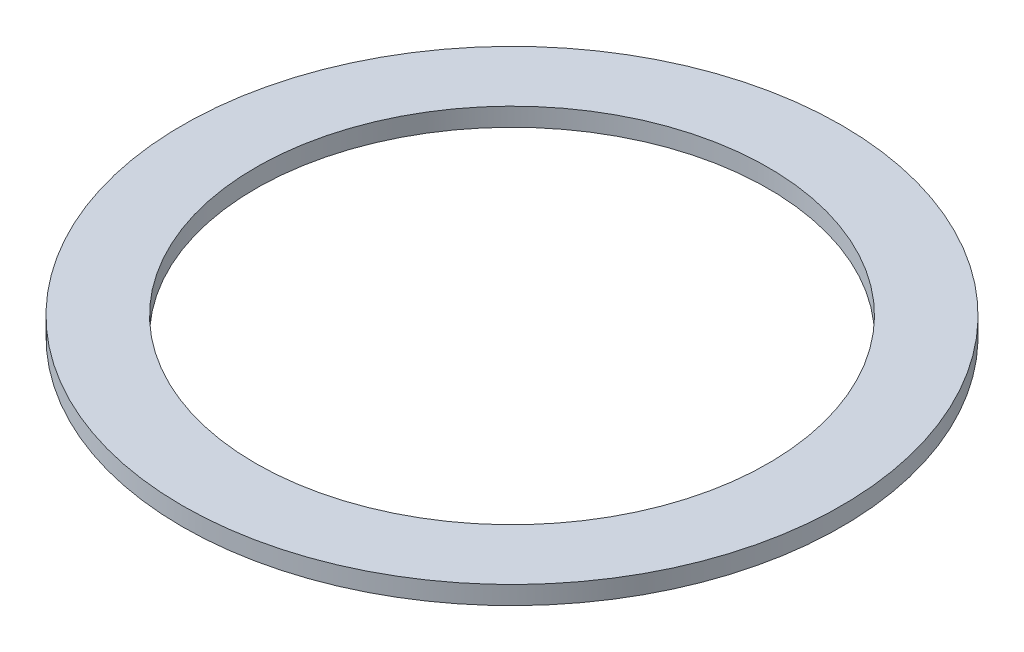
ISO-10303-21;
HEADER;
FILE_DESCRIPTION(('STEP AP214'),'2;1');
FILE_NAME('part.step','',(''),(''),'','','');
FILE_SCHEMA(('AUTOMOTIVE_DESIGN { 1 0 10303 214 1 1 1 1 }'));
ENDSEC;
DATA;
#1=APPLICATION_CONTEXT('core data for automotive mechanical design processes');
#2=APPLICATION_PROTOCOL_DEFINITION('international standard','automotive_design',2000,#1);
#3=PRODUCT_CONTEXT('',#1,'mechanical');
#4=PRODUCT('Part','Part','',(#3));
#5=PRODUCT_RELATED_PRODUCT_CATEGORY('part','',(#4));
#6=PRODUCT_DEFINITION_FORMATION('','',#4);
#7=PRODUCT_DEFINITION_CONTEXT('part definition',#1,'design');
#8=PRODUCT_DEFINITION('design','',#6,#7);
#9=PRODUCT_DEFINITION_SHAPE('','',#8);
#10=(LENGTH_UNIT() NAMED_UNIT(*) SI_UNIT(.MILLI.,.METRE.));
#11=(NAMED_UNIT(*) PLANE_ANGLE_UNIT() SI_UNIT($,.RADIAN.));
#12=(NAMED_UNIT(*) SI_UNIT($,.STERADIAN.) SOLID_ANGLE_UNIT());
#13=UNCERTAINTY_MEASURE_WITH_UNIT(LENGTH_MEASURE(1.E-05),#10,'distance_accuracy_value','');
#14=(GEOMETRIC_REPRESENTATION_CONTEXT(3) GLOBAL_UNCERTAINTY_ASSIGNED_CONTEXT((#13)) GLOBAL_UNIT_ASSIGNED_CONTEXT((#10,
#11,#12)) REPRESENTATION_CONTEXT('',''));
#15=CARTESIAN_POINT('',(0.,0.,0.));
#16=DIRECTION('',(0.,0.,1.));
#17=DIRECTION('',(1.,0.,0.));
#18=AXIS2_PLACEMENT_3D('',#15,#16,#17);
#19=CARTESIAN_POINT('',(0.,5.,0.));
#20=DIRECTION('',(0.,1.,0.));
#21=DIRECTION('',(0.,0.,1.));
#22=AXIS2_PLACEMENT_3D('',#19,#20,#21);
#23=PLANE('',#22);
#24=CARTESIAN_POINT('',(0.,5.,0.));
#25=DIRECTION('',(0.,1.,0.));
#26=DIRECTION('',(0.,0.,1.));
#27=AXIS2_PLACEMENT_3D('',#24,#25,#26);
#28=CIRCLE('',#27,90.);
#29=CARTESIAN_POINT('',(0.,5.,90.));
#30=VERTEX_POINT('',#29);
#31=EDGE_CURVE('E10',#30,#30,#28,.T.);
#32=ORIENTED_EDGE('',*,*,#31,.T.);
#33=EDGE_LOOP('',(#32));
#34=FACE_BOUND('',#33,.T.);
#35=CARTESIAN_POINT('',(0.,5.,0.));
#36=DIRECTION('',(0.,1.,0.));
#37=DIRECTION('',(0.,0.,1.));
#38=AXIS2_PLACEMENT_3D('',#35,#36,#37);
#39=CIRCLE('',#38,70.);
#40=CARTESIAN_POINT('',(0.,5.,70.));
#41=VERTEX_POINT('',#40);
#42=EDGE_CURVE('E47',#41,#41,#39,.T.);
#43=ORIENTED_EDGE('',*,*,#42,.F.);
#44=EDGE_LOOP('',(#43));
#45=FACE_BOUND('',#44,.T.);
#46=ADVANCED_FACE('F36',(#34,#45),#23,.T.);
#47=CARTESIAN_POINT('',(0.,0.,0.));
#48=DIRECTION('',(0.,1.,0.));
#49=DIRECTION('',(0.,0.,1.));
#50=AXIS2_PLACEMENT_3D('',#47,#48,#49);
#51=PLANE('',#50);
#52=CARTESIAN_POINT('',(0.,0.,0.));
#53=DIRECTION('',(0.,1.,0.));
#54=DIRECTION('',(0.,0.,1.));
#55=AXIS2_PLACEMENT_3D('',#52,#53,#54);
#56=CIRCLE('',#55,90.);
#57=CARTESIAN_POINT('',(0.,0.,90.));
#58=VERTEX_POINT('',#57);
#59=EDGE_CURVE('E40',#58,#58,#56,.T.);
#60=ORIENTED_EDGE('',*,*,#59,.F.);
#61=EDGE_LOOP('',(#60));
#62=FACE_BOUND('',#61,.T.);
#63=CARTESIAN_POINT('',(0.,0.,0.));
#64=DIRECTION('',(0.,1.,0.));
#65=DIRECTION('',(0.,0.,1.));
#66=AXIS2_PLACEMENT_3D('',#63,#64,#65);
#67=CIRCLE('',#66,70.);
#68=CARTESIAN_POINT('',(0.,0.,70.));
#69=VERTEX_POINT('',#68);
#70=EDGE_CURVE('E49',#69,#69,#67,.T.);
#71=ORIENTED_EDGE('',*,*,#70,.T.);
#72=EDGE_LOOP('',(#71));
#73=FACE_BOUND('',#72,.T.);
#74=ADVANCED_FACE('F59',(#62,#73),#51,.F.);
#75=CARTESIAN_POINT('',(0.,5.,0.));
#76=DIRECTION('',(0.,-1.,0.));
#77=DIRECTION('',(0.,0.,-1.));
#78=AXIS2_PLACEMENT_3D('',#75,#76,#77);
#79=CYLINDRICAL_SURFACE('',#78,90.);
#80=ORIENTED_EDGE('',*,*,#31,.F.);
#81=EDGE_LOOP('',(#80));
#82=FACE_BOUND('',#81,.T.);
#83=ORIENTED_EDGE('',*,*,#59,.T.);
#84=EDGE_LOOP('',(#83));
#85=FACE_BOUND('',#84,.T.);
#86=ADVANCED_FACE('F38',(#82,#85),#79,.T.);
#87=CARTESIAN_POINT('',(0.,5.,0.));
#88=DIRECTION('',(0.,-1.,0.));
#89=DIRECTION('',(0.,0.,-1.));
#90=AXIS2_PLACEMENT_3D('',#87,#88,#89);
#91=CYLINDRICAL_SURFACE('',#90,70.);
#92=ORIENTED_EDGE('',*,*,#42,.T.);
#93=EDGE_LOOP('',(#92));
#94=FACE_BOUND('',#93,.T.);
#95=ORIENTED_EDGE('',*,*,#70,.F.);
#96=EDGE_LOOP('',(#95));
#97=FACE_BOUND('',#96,.T.);
#98=ADVANCED_FACE('F55',(#94,#97),#91,.F.);
#99=CLOSED_SHELL('',(#46,#74,#86,#98));
#100=MANIFOLD_SOLID_BREP('B2',#99);
#101=ADVANCED_BREP_SHAPE_REPRESENTATION('',(#18,#100),#14);
#102=SHAPE_DEFINITION_REPRESENTATION(#9,#101);
ENDSEC;
END-ISO-10303-21;
